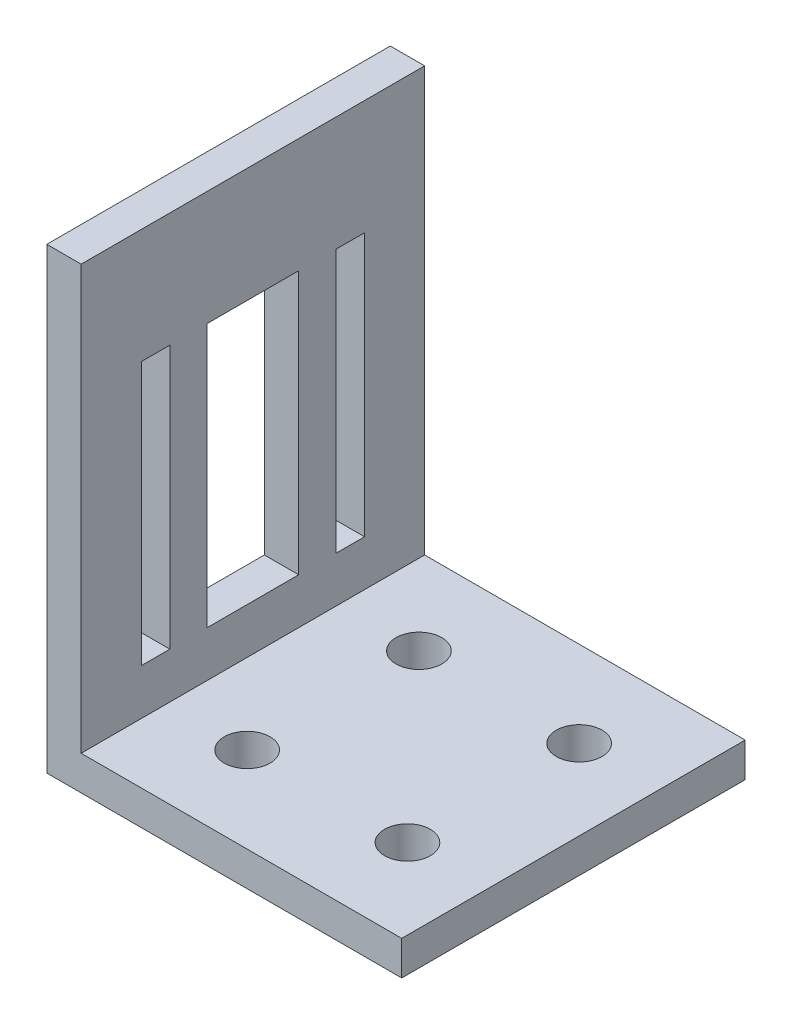
ISO-10303-21;
HEADER;
FILE_DESCRIPTION(('STEP AP214'),'2;1');
FILE_NAME('part.step','',(''),(''),'','','');
FILE_SCHEMA(('AUTOMOTIVE_DESIGN { 1 0 10303 214 1 1 1 1 }'));
ENDSEC;
DATA;
#1=APPLICATION_CONTEXT('core data for automotive mechanical design processes');
#2=APPLICATION_PROTOCOL_DEFINITION('international standard','automotive_design',2000,#1);
#3=PRODUCT_CONTEXT('',#1,'mechanical');
#4=PRODUCT('Part','Part','',(#3));
#5=PRODUCT_RELATED_PRODUCT_CATEGORY('part','',(#4));
#6=PRODUCT_DEFINITION_FORMATION('','',#4);
#7=PRODUCT_DEFINITION_CONTEXT('part definition',#1,'design');
#8=PRODUCT_DEFINITION('design','',#6,#7);
#9=PRODUCT_DEFINITION_SHAPE('','',#8);
#10=(LENGTH_UNIT() NAMED_UNIT(*) SI_UNIT(.MILLI.,.METRE.));
#11=(NAMED_UNIT(*) PLANE_ANGLE_UNIT() SI_UNIT($,.RADIAN.));
#12=(NAMED_UNIT(*) SI_UNIT($,.STERADIAN.) SOLID_ANGLE_UNIT());
#13=UNCERTAINTY_MEASURE_WITH_UNIT(LENGTH_MEASURE(1.E-05),#10,'distance_accuracy_value','');
#14=(GEOMETRIC_REPRESENTATION_CONTEXT(3) GLOBAL_UNCERTAINTY_ASSIGNED_CONTEXT((#13)) GLOBAL_UNIT_ASSIGNED_CONTEXT((#10,
#11,#12)) REPRESENTATION_CONTEXT('',''));
#15=CARTESIAN_POINT('',(0.,0.,0.));
#16=DIRECTION('',(0.,0.,1.));
#17=DIRECTION('',(1.,0.,0.));
#18=AXIS2_PLACEMENT_3D('',#15,#16,#17);
#19=CARTESIAN_POINT('',(0.,0.,30.));
#20=DIRECTION('',(-1.,0.,0.));
#21=DIRECTION('',(0.,-1.,0.));
#22=AXIS2_PLACEMENT_3D('',#19,#20,#21);
#23=PLANE('',#22);
#24=DIRECTION('',(0.,1.,0.));
#25=VECTOR('',#24,1.);
#26=CARTESIAN_POINT('',(0.,0.,0.));
#27=LINE('',#26,#25);
#28=CARTESIAN_POINT('',(0.,0.,0.));
#29=VERTEX_POINT('',#28);
#30=CARTESIAN_POINT('',(0.,3.,0.));
#31=VERTEX_POINT('',#30);
#32=EDGE_CURVE('E283',#29,#31,#27,.T.);
#33=ORIENTED_EDGE('',*,*,#32,.T.);
#34=DIRECTION('',(0.,0.,-1.));
#35=VECTOR('',#34,1.);
#36=CARTESIAN_POINT('',(0.,3.,30.));
#37=LINE('',#36,#35);
#38=CARTESIAN_POINT('',(0.,3.,30.));
#39=VERTEX_POINT('',#38);
#40=EDGE_CURVE('E11',#39,#31,#37,.T.);
#41=ORIENTED_EDGE('',*,*,#40,.F.);
#42=DIRECTION('',(0.,1.,0.));
#43=VECTOR('',#42,1.);
#44=CARTESIAN_POINT('',(0.,0.,30.));
#45=LINE('',#44,#43);
#46=CARTESIAN_POINT('',(0.,0.,30.));
#47=VERTEX_POINT('',#46);
#48=EDGE_CURVE('E286',#47,#39,#45,.T.);
#49=ORIENTED_EDGE('',*,*,#48,.F.);
#50=DIRECTION('',(0.,0.,-1.));
#51=VECTOR('',#50,1.);
#52=CARTESIAN_POINT('',(0.,0.,30.));
#53=LINE('',#52,#51);
#54=EDGE_CURVE('E300',#47,#29,#53,.T.);
#55=ORIENTED_EDGE('',*,*,#54,.T.);
#56=EDGE_LOOP('',(#33,#41,#49,#55));
#57=FACE_BOUND('',#56,.T.);
#58=ADVANCED_FACE('F35',(#57),#23,.F.);
#59=CARTESIAN_POINT('',(0.,3.,30.));
#60=DIRECTION('',(0.,-1.,0.));
#61=DIRECTION('',(1.,0.,0.));
#62=AXIS2_PLACEMENT_3D('',#59,#60,#61);
#63=PLANE('',#62);
#64=CARTESIAN_POINT('',(-21.,3.,22.5));
#65=DIRECTION('',(0.,1.,0.));
#66=DIRECTION('',(0.,0.,-1.));
#67=AXIS2_PLACEMENT_3D('',#64,#65,#66);
#68=CIRCLE('',#67,2.);
#69=CARTESIAN_POINT('',(-21.,3.,20.5));
#70=VERTEX_POINT('',#69);
#71=EDGE_CURVE('E272',#70,#70,#68,.T.);
#72=ORIENTED_EDGE('',*,*,#71,.F.);
#73=EDGE_LOOP('',(#72));
#74=FACE_BOUND('',#73,.T.);
#75=CARTESIAN_POINT('',(-7.,3.,7.5));
#76=DIRECTION('',(0.,1.,0.));
#77=DIRECTION('',(0.,0.,-1.));
#78=AXIS2_PLACEMENT_3D('',#75,#76,#77);
#79=CIRCLE('',#78,2.);
#80=CARTESIAN_POINT('',(-7.,3.,5.5));
#81=VERTEX_POINT('',#80);
#82=EDGE_CURVE('E265',#81,#81,#79,.T.);
#83=ORIENTED_EDGE('',*,*,#82,.F.);
#84=EDGE_LOOP('',(#83));
#85=FACE_BOUND('',#84,.T.);
#86=CARTESIAN_POINT('',(-21.,3.,7.5));
#87=DIRECTION('',(0.,1.,0.));
#88=DIRECTION('',(0.,0.,1.));
#89=AXIS2_PLACEMENT_3D('',#86,#87,#88);
#90=CIRCLE('',#89,2.);
#91=CARTESIAN_POINT('',(-21.,3.,9.5));
#92=VERTEX_POINT('',#91);
#93=EDGE_CURVE('E261',#92,#92,#90,.T.);
#94=ORIENTED_EDGE('',*,*,#93,.F.);
#95=EDGE_LOOP('',(#94));
#96=FACE_BOUND('',#95,.T.);
#97=CARTESIAN_POINT('',(-7.,3.,22.5));
#98=DIRECTION('',(0.,1.,0.));
#99=DIRECTION('',(0.,0.,1.));
#100=AXIS2_PLACEMENT_3D('',#97,#98,#99);
#101=CIRCLE('',#100,2.);
#102=CARTESIAN_POINT('',(-7.,3.,24.5));
#103=VERTEX_POINT('',#102);
#104=EDGE_CURVE('E271',#103,#103,#101,.T.);
#105=ORIENTED_EDGE('',*,*,#104,.F.);
#106=EDGE_LOOP('',(#105));
#107=FACE_BOUND('',#106,.T.);
#108=DIRECTION('',(-1.,0.,0.));
#109=VECTOR('',#108,1.);
#110=CARTESIAN_POINT('',(0.,3.,0.));
#111=LINE('',#110,#109);
#112=CARTESIAN_POINT('',(-28.,3.,0.));
#113=VERTEX_POINT('',#112);
#114=EDGE_CURVE('E303',#31,#113,#111,.T.);
#115=ORIENTED_EDGE('',*,*,#114,.T.);
#116=DIRECTION('',(0.,0.,-1.));
#117=VECTOR('',#116,1.);
#118=CARTESIAN_POINT('',(-28.,3.,30.));
#119=LINE('',#118,#117);
#120=CARTESIAN_POINT('',(-28.,3.,30.));
#121=VERTEX_POINT('',#120);
#122=EDGE_CURVE('E42',#121,#113,#119,.T.);
#123=ORIENTED_EDGE('',*,*,#122,.F.);
#124=DIRECTION('',(-1.,0.,0.));
#125=VECTOR('',#124,1.);
#126=CARTESIAN_POINT('',(0.,3.,30.));
#127=LINE('',#126,#125);
#128=EDGE_CURVE('E289',#39,#121,#127,.T.);
#129=ORIENTED_EDGE('',*,*,#128,.F.);
#130=ORIENTED_EDGE('',*,*,#40,.T.);
#131=EDGE_LOOP('',(#115,#123,#129,#130));
#132=FACE_BOUND('',#131,.T.);
#133=ADVANCED_FACE('F349',(#74,#85,#96,#107,#132),#63,.F.);
#134=CARTESIAN_POINT('',(-28.,3.,30.));
#135=DIRECTION('',(-1.,0.,0.));
#136=DIRECTION('',(0.,0.,1.));
#137=AXIS2_PLACEMENT_3D('',#134,#135,#136);
#138=PLANE('',#137);
#139=DIRECTION('',(0.,1.,0.));
#140=VECTOR('',#139,1.);
#141=CARTESIAN_POINT('',(-28.,3.,24.75));
#142=LINE('',#141,#140);
#143=CARTESIAN_POINT('',(-28.,7.,24.75));
#144=VERTEX_POINT('',#143);
#145=CARTESIAN_POINT('',(-28.,30.,24.75));
#146=VERTEX_POINT('',#145);
#147=EDGE_CURVE('E255',#144,#146,#142,.T.);
#148=ORIENTED_EDGE('',*,*,#147,.T.);
#149=DIRECTION('',(0.,0.,-1.));
#150=VECTOR('',#149,1.);
#151=CARTESIAN_POINT('',(-28.,30.,30.));
#152=LINE('',#151,#150);
#153=CARTESIAN_POINT('',(-28.,30.,22.25));
#154=VERTEX_POINT('',#153);
#155=EDGE_CURVE('E258',#146,#154,#152,.T.);
#156=ORIENTED_EDGE('',*,*,#155,.T.);
#157=DIRECTION('',(0.,-1.,0.));
#158=VECTOR('',#157,1.);
#159=CARTESIAN_POINT('',(-28.,3.,22.25));
#160=LINE('',#159,#158);
#161=CARTESIAN_POINT('',(-28.,7.,22.25));
#162=VERTEX_POINT('',#161);
#163=EDGE_CURVE('E252',#154,#162,#160,.T.);
#164=ORIENTED_EDGE('',*,*,#163,.T.);
#165=DIRECTION('',(0.,0.,1.));
#166=VECTOR('',#165,1.);
#167=CARTESIAN_POINT('',(-28.,7.,30.));
#168=LINE('',#167,#166);
#169=EDGE_CURVE('E164',#162,#144,#168,.T.);
#170=ORIENTED_EDGE('',*,*,#169,.T.);
#171=EDGE_LOOP('',(#148,#156,#164,#170));
#172=FACE_BOUND('',#171,.T.);
#173=DIRECTION('',(0.,1.,0.));
#174=VECTOR('',#173,1.);
#175=CARTESIAN_POINT('',(-28.,2.99999999999999,19.));
#176=LINE('',#175,#174);
#177=CARTESIAN_POINT('',(-28.,7.,19.));
#178=VERTEX_POINT('',#177);
#179=CARTESIAN_POINT('',(-28.,30.,19.));
#180=VERTEX_POINT('',#179);
#181=EDGE_CURVE('E246',#178,#180,#176,.T.);
#182=ORIENTED_EDGE('',*,*,#181,.T.);
#183=DIRECTION('',(0.,0.,-1.));
#184=VECTOR('',#183,1.);
#185=CARTESIAN_POINT('',(-28.,30.,30.));
#186=LINE('',#185,#184);
#187=CARTESIAN_POINT('',(-28.,30.,11.));
#188=VERTEX_POINT('',#187);
#189=EDGE_CURVE('E249',#180,#188,#186,.T.);
#190=ORIENTED_EDGE('',*,*,#189,.T.);
#191=DIRECTION('',(0.,-1.,0.));
#192=VECTOR('',#191,1.);
#193=CARTESIAN_POINT('',(-28.,3.,11.));
#194=LINE('',#193,#192);
#195=CARTESIAN_POINT('',(-28.,7.,11.));
#196=VERTEX_POINT('',#195);
#197=EDGE_CURVE('E240',#188,#196,#194,.T.);
#198=ORIENTED_EDGE('',*,*,#197,.T.);
#199=DIRECTION('',(0.,0.,1.));
#200=VECTOR('',#199,1.);
#201=CARTESIAN_POINT('',(-28.,7.,30.));
#202=LINE('',#201,#200);
#203=EDGE_CURVE('E243',#196,#178,#202,.T.);
#204=ORIENTED_EDGE('',*,*,#203,.T.);
#205=EDGE_LOOP('',(#182,#190,#198,#204));
#206=FACE_BOUND('',#205,.T.);
#207=DIRECTION('',(0.,0.,1.));
#208=VECTOR('',#207,1.);
#209=CARTESIAN_POINT('',(-28.,7.00000000000001,30.));
#210=LINE('',#209,#208);
#211=CARTESIAN_POINT('',(-28.,7.,5.25));
#212=VERTEX_POINT('',#211);
#213=CARTESIAN_POINT('',(-28.,7.,7.75000000000001));
#214=VERTEX_POINT('',#213);
#215=EDGE_CURVE('E234',#212,#214,#210,.T.);
#216=ORIENTED_EDGE('',*,*,#215,.T.);
#217=DIRECTION('',(0.,1.,0.));
#218=VECTOR('',#217,1.);
#219=CARTESIAN_POINT('',(-28.,2.99999999999999,7.75));
#220=LINE('',#219,#218);
#221=CARTESIAN_POINT('',(-28.,30.,7.75));
#222=VERTEX_POINT('',#221);
#223=EDGE_CURVE('E237',#214,#222,#220,.T.);
#224=ORIENTED_EDGE('',*,*,#223,.T.);
#225=DIRECTION('',(0.,0.,-1.));
#226=VECTOR('',#225,1.);
#227=CARTESIAN_POINT('',(-28.,30.,30.));
#228=LINE('',#227,#226);
#229=CARTESIAN_POINT('',(-28.,30.,5.25));
#230=VERTEX_POINT('',#229);
#231=EDGE_CURVE('E188',#222,#230,#228,.T.);
#232=ORIENTED_EDGE('',*,*,#231,.T.);
#233=DIRECTION('',(0.,-1.,0.));
#234=VECTOR('',#233,1.);
#235=CARTESIAN_POINT('',(-28.,3.,5.25));
#236=LINE('',#235,#234);
#237=EDGE_CURVE('E231',#230,#212,#236,.T.);
#238=ORIENTED_EDGE('',*,*,#237,.T.);
#239=EDGE_LOOP('',(#216,#224,#232,#238));
#240=FACE_BOUND('',#239,.T.);
#241=DIRECTION('',(0.,1.,0.));
#242=VECTOR('',#241,1.);
#243=CARTESIAN_POINT('',(-28.,3.,0.));
#244=LINE('',#243,#242);
#245=CARTESIAN_POINT('',(-28.,40.,0.));
#246=VERTEX_POINT('',#245);
#247=EDGE_CURVE('E305',#113,#246,#244,.T.);
#248=ORIENTED_EDGE('',*,*,#247,.T.);
#249=DIRECTION('',(0.,0.,-1.));
#250=VECTOR('',#249,1.);
#251=CARTESIAN_POINT('',(-28.,40.,30.));
#252=LINE('',#251,#250);
#253=CARTESIAN_POINT('',(-28.,40.,30.));
#254=VERTEX_POINT('',#253);
#255=EDGE_CURVE('E320',#254,#246,#252,.T.);
#256=ORIENTED_EDGE('',*,*,#255,.F.);
#257=DIRECTION('',(0.,1.,0.));
#258=VECTOR('',#257,1.);
#259=CARTESIAN_POINT('',(-28.,3.,30.));
#260=LINE('',#259,#258);
#261=EDGE_CURVE('E292',#121,#254,#260,.T.);
#262=ORIENTED_EDGE('',*,*,#261,.F.);
#263=ORIENTED_EDGE('',*,*,#122,.T.);
#264=EDGE_LOOP('',(#248,#256,#262,#263));
#265=FACE_BOUND('',#264,.T.);
#266=ADVANCED_FACE('F327',(#172,#206,#240,#265),#138,.F.);
#267=CARTESIAN_POINT('',(-28.,40.,30.));
#268=DIRECTION('',(0.,-1.,0.));
#269=DIRECTION('',(0.,0.,-1.));
#270=AXIS2_PLACEMENT_3D('',#267,#268,#269);
#271=PLANE('',#270);
#272=DIRECTION('',(-1.,0.,0.));
#273=VECTOR('',#272,1.);
#274=CARTESIAN_POINT('',(-28.,40.,0.));
#275=LINE('',#274,#273);
#276=CARTESIAN_POINT('',(-31.,40.,0.));
#277=VERTEX_POINT('',#276);
#278=EDGE_CURVE('E307',#246,#277,#275,.T.);
#279=ORIENTED_EDGE('',*,*,#278,.T.);
#280=DIRECTION('',(0.,0.,-1.));
#281=VECTOR('',#280,1.);
#282=CARTESIAN_POINT('',(-31.,40.,30.));
#283=LINE('',#282,#281);
#284=CARTESIAN_POINT('',(-31.,40.,30.));
#285=VERTEX_POINT('',#284);
#286=EDGE_CURVE('E317',#285,#277,#283,.T.);
#287=ORIENTED_EDGE('',*,*,#286,.F.);
#288=DIRECTION('',(-1.,0.,0.));
#289=VECTOR('',#288,1.);
#290=CARTESIAN_POINT('',(-28.,40.,30.));
#291=LINE('',#290,#289);
#292=EDGE_CURVE('E294',#254,#285,#291,.T.);
#293=ORIENTED_EDGE('',*,*,#292,.F.);
#294=ORIENTED_EDGE('',*,*,#255,.T.);
#295=EDGE_LOOP('',(#279,#287,#293,#294));
#296=FACE_BOUND('',#295,.T.);
#297=ADVANCED_FACE('F338',(#296),#271,.F.);
#298=CARTESIAN_POINT('',(-31.,0.,30.));
#299=DIRECTION('',(1.,0.,0.));
#300=DIRECTION('',(0.,0.,-1.));
#301=AXIS2_PLACEMENT_3D('',#298,#299,#300);
#302=PLANE('',#301);
#303=DIRECTION('',(0.,-1.,0.));
#304=VECTOR('',#303,1.);
#305=CARTESIAN_POINT('',(-31.,30.,22.25));
#306=LINE('',#305,#304);
#307=CARTESIAN_POINT('',(-31.,30.,22.25));
#308=VERTEX_POINT('',#307);
#309=CARTESIAN_POINT('',(-31.,7.,22.25));
#310=VERTEX_POINT('',#309);
#311=EDGE_CURVE('E171',#308,#310,#306,.T.);
#312=ORIENTED_EDGE('',*,*,#311,.F.);
#313=DIRECTION('',(0.,0.,-1.));
#314=VECTOR('',#313,1.);
#315=CARTESIAN_POINT('',(-31.,30.,22.25));
#316=LINE('',#315,#314);
#317=CARTESIAN_POINT('',(-31.,30.,24.75));
#318=VERTEX_POINT('',#317);
#319=EDGE_CURVE('E176',#318,#308,#316,.T.);
#320=ORIENTED_EDGE('',*,*,#319,.F.);
#321=DIRECTION('',(0.,1.,0.));
#322=VECTOR('',#321,1.);
#323=CARTESIAN_POINT('',(-31.,30.,24.75));
#324=LINE('',#323,#322);
#325=CARTESIAN_POINT('',(-31.,7.,24.75));
#326=VERTEX_POINT('',#325);
#327=EDGE_CURVE('E181',#326,#318,#324,.T.);
#328=ORIENTED_EDGE('',*,*,#327,.F.);
#329=DIRECTION('',(0.,0.,1.));
#330=VECTOR('',#329,1.);
#331=CARTESIAN_POINT('',(-31.,7.,24.75));
#332=LINE('',#331,#330);
#333=EDGE_CURVE('E161',#310,#326,#332,.T.);
#334=ORIENTED_EDGE('',*,*,#333,.F.);
#335=EDGE_LOOP('',(#312,#320,#328,#334));
#336=FACE_BOUND('',#335,.T.);
#337=DIRECTION('',(0.,-1.,0.));
#338=VECTOR('',#337,1.);
#339=CARTESIAN_POINT('',(-31.,30.,11.));
#340=LINE('',#339,#338);
#341=CARTESIAN_POINT('',(-31.,30.,11.));
#342=VERTEX_POINT('',#341);
#343=CARTESIAN_POINT('',(-31.,7.,11.));
#344=VERTEX_POINT('',#343);
#345=EDGE_CURVE('E193',#342,#344,#340,.T.);
#346=ORIENTED_EDGE('',*,*,#345,.F.);
#347=DIRECTION('',(0.,0.,-1.));
#348=VECTOR('',#347,1.);
#349=CARTESIAN_POINT('',(-31.,30.,19.));
#350=LINE('',#349,#348);
#351=CARTESIAN_POINT('',(-31.,30.,19.));
#352=VERTEX_POINT('',#351);
#353=EDGE_CURVE('E191',#352,#342,#350,.T.);
#354=ORIENTED_EDGE('',*,*,#353,.F.);
#355=DIRECTION('',(0.,1.,0.));
#356=VECTOR('',#355,1.);
#357=CARTESIAN_POINT('',(-31.,30.,19.));
#358=LINE('',#357,#356);
#359=CARTESIAN_POINT('',(-31.,7.,19.));
#360=VERTEX_POINT('',#359);
#361=EDGE_CURVE('E199',#360,#352,#358,.T.);
#362=ORIENTED_EDGE('',*,*,#361,.F.);
#363=DIRECTION('',(0.,0.,1.));
#364=VECTOR('',#363,1.);
#365=CARTESIAN_POINT('',(-31.,7.,19.));
#366=LINE('',#365,#364);
#367=EDGE_CURVE('E196',#344,#360,#366,.T.);
#368=ORIENTED_EDGE('',*,*,#367,.F.);
#369=EDGE_LOOP('',(#346,#354,#362,#368));
#370=FACE_BOUND('',#369,.T.);
#371=DIRECTION('',(0.,0.,-1.));
#372=VECTOR('',#371,1.);
#373=CARTESIAN_POINT('',(-31.,30.,7.75));
#374=LINE('',#373,#372);
#375=CARTESIAN_POINT('',(-31.,30.,7.75));
#376=VERTEX_POINT('',#375);
#377=CARTESIAN_POINT('',(-31.,30.,5.25));
#378=VERTEX_POINT('',#377);
#379=EDGE_CURVE('E212',#376,#378,#374,.T.);
#380=ORIENTED_EDGE('',*,*,#379,.F.);
#381=DIRECTION('',(0.,1.,0.));
#382=VECTOR('',#381,1.);
#383=CARTESIAN_POINT('',(-31.,30.,7.75));
#384=LINE('',#383,#382);
#385=CARTESIAN_POINT('',(-31.,7.,7.75000000000001));
#386=VERTEX_POINT('',#385);
#387=EDGE_CURVE('E210',#386,#376,#384,.T.);
#388=ORIENTED_EDGE('',*,*,#387,.F.);
#389=DIRECTION('',(0.,0.,1.));
#390=VECTOR('',#389,1.);
#391=CARTESIAN_POINT('',(-31.,7.,5.25));
#392=LINE('',#391,#390);
#393=CARTESIAN_POINT('',(-31.,7.,5.25));
#394=VERTEX_POINT('',#393);
#395=EDGE_CURVE('E218',#394,#386,#392,.T.);
#396=ORIENTED_EDGE('',*,*,#395,.F.);
#397=DIRECTION('',(0.,-1.,0.));
#398=VECTOR('',#397,1.);
#399=CARTESIAN_POINT('',(-31.,30.,5.25));
#400=LINE('',#399,#398);
#401=EDGE_CURVE('E215',#378,#394,#400,.T.);
#402=ORIENTED_EDGE('',*,*,#401,.F.);
#403=EDGE_LOOP('',(#380,#388,#396,#402));
#404=FACE_BOUND('',#403,.T.);
#405=DIRECTION('',(0.,-1.,0.));
#406=VECTOR('',#405,1.);
#407=CARTESIAN_POINT('',(-31.,0.,0.));
#408=LINE('',#407,#406);
#409=CARTESIAN_POINT('',(-31.,0.,0.));
#410=VERTEX_POINT('',#409);
#411=EDGE_CURVE('E309',#277,#410,#408,.T.);
#412=ORIENTED_EDGE('',*,*,#411,.T.);
#413=DIRECTION('',(0.,0.,-1.));
#414=VECTOR('',#413,1.);
#415=CARTESIAN_POINT('',(-31.,0.,30.));
#416=LINE('',#415,#414);
#417=CARTESIAN_POINT('',(-31.,0.,30.));
#418=VERTEX_POINT('',#417);
#419=EDGE_CURVE('E314',#418,#410,#416,.T.);
#420=ORIENTED_EDGE('',*,*,#419,.F.);
#421=DIRECTION('',(0.,-1.,0.));
#422=VECTOR('',#421,1.);
#423=CARTESIAN_POINT('',(-31.,0.,30.));
#424=LINE('',#423,#422);
#425=EDGE_CURVE('E296',#285,#418,#424,.T.);
#426=ORIENTED_EDGE('',*,*,#425,.F.);
#427=ORIENTED_EDGE('',*,*,#286,.T.);
#428=EDGE_LOOP('',(#412,#420,#426,#427));
#429=FACE_BOUND('',#428,.T.);
#430=ADVANCED_FACE('F178',(#336,#370,#404,#429),#302,.F.);
#431=CARTESIAN_POINT('',(0.,0.,30.));
#432=DIRECTION('',(0.,1.,0.));
#433=DIRECTION('',(0.,0.,1.));
#434=AXIS2_PLACEMENT_3D('',#431,#432,#433);
#435=PLANE('',#434);
#436=CARTESIAN_POINT('',(-21.,0.,22.5));
#437=DIRECTION('',(0.,1.,0.));
#438=DIRECTION('',(0.,0.,-1.));
#439=AXIS2_PLACEMENT_3D('',#436,#437,#438);
#440=CIRCLE('',#439,2.);
#441=CARTESIAN_POINT('',(-21.,0.,20.5));
#442=VERTEX_POINT('',#441);
#443=EDGE_CURVE('E268',#442,#442,#440,.T.);
#444=ORIENTED_EDGE('',*,*,#443,.T.);
#445=EDGE_LOOP('',(#444));
#446=FACE_BOUND('',#445,.T.);
#447=CARTESIAN_POINT('',(-7.,0.,7.5));
#448=DIRECTION('',(0.,1.,0.));
#449=DIRECTION('',(0.,0.,-1.));
#450=AXIS2_PLACEMENT_3D('',#447,#448,#449);
#451=CIRCLE('',#450,2.);
#452=CARTESIAN_POINT('',(-7.,0.,5.5));
#453=VERTEX_POINT('',#452);
#454=EDGE_CURVE('E275',#453,#453,#451,.T.);
#455=ORIENTED_EDGE('',*,*,#454,.T.);
#456=EDGE_LOOP('',(#455));
#457=FACE_BOUND('',#456,.T.);
#458=CARTESIAN_POINT('',(-21.,0.,7.5));
#459=DIRECTION('',(0.,1.,0.));
#460=DIRECTION('',(0.,0.,1.));
#461=AXIS2_PLACEMENT_3D('',#458,#459,#460);
#462=CIRCLE('',#461,2.);
#463=CARTESIAN_POINT('',(-21.,0.,9.5));
#464=VERTEX_POINT('',#463);
#465=EDGE_CURVE('E262',#464,#464,#462,.T.);
#466=ORIENTED_EDGE('',*,*,#465,.T.);
#467=EDGE_LOOP('',(#466));
#468=FACE_BOUND('',#467,.T.);
#469=CARTESIAN_POINT('',(-7.,0.,22.5));
#470=DIRECTION('',(0.,1.,0.));
#471=DIRECTION('',(0.,0.,1.));
#472=AXIS2_PLACEMENT_3D('',#469,#470,#471);
#473=CIRCLE('',#472,2.);
#474=CARTESIAN_POINT('',(-7.,0.,24.5));
#475=VERTEX_POINT('',#474);
#476=EDGE_CURVE('E280',#475,#475,#473,.T.);
#477=ORIENTED_EDGE('',*,*,#476,.T.);
#478=EDGE_LOOP('',(#477));
#479=FACE_BOUND('',#478,.T.);
#480=DIRECTION('',(1.,0.,0.));
#481=VECTOR('',#480,1.);
#482=CARTESIAN_POINT('',(0.,0.,0.));
#483=LINE('',#482,#481);
#484=EDGE_CURVE('E290',#410,#29,#483,.T.);
#485=ORIENTED_EDGE('',*,*,#484,.T.);
#486=ORIENTED_EDGE('',*,*,#54,.F.);
#487=DIRECTION('',(1.,0.,0.));
#488=VECTOR('',#487,1.);
#489=CARTESIAN_POINT('',(0.,0.,30.));
#490=LINE('',#489,#488);
#491=EDGE_CURVE('E298',#418,#47,#490,.T.);
#492=ORIENTED_EDGE('',*,*,#491,.F.);
#493=ORIENTED_EDGE('',*,*,#419,.T.);
#494=EDGE_LOOP('',(#485,#486,#492,#493));
#495=FACE_BOUND('',#494,.T.);
#496=ADVANCED_FACE('F352',(#446,#457,#468,#479,#495),#435,.F.);
#497=CARTESIAN_POINT('',(0.,0.,30.));
#498=DIRECTION('',(0.,0.,1.));
#499=DIRECTION('',(1.,0.,0.));
#500=AXIS2_PLACEMENT_3D('',#497,#498,#499);
#501=PLANE('',#500);
#502=ORIENTED_EDGE('',*,*,#48,.T.);
#503=ORIENTED_EDGE('',*,*,#128,.T.);
#504=ORIENTED_EDGE('',*,*,#261,.T.);
#505=ORIENTED_EDGE('',*,*,#292,.T.);
#506=ORIENTED_EDGE('',*,*,#425,.T.);
#507=ORIENTED_EDGE('',*,*,#491,.T.);
#508=EDGE_LOOP('',(#502,#503,#504,#505,#506,#507));
#509=FACE_BOUND('',#508,.T.);
#510=ADVANCED_FACE('F345',(#509),#501,.T.);
#511=CARTESIAN_POINT('',(0.,0.,0.));
#512=DIRECTION('',(0.,0.,1.));
#513=DIRECTION('',(1.,0.,0.));
#514=AXIS2_PLACEMENT_3D('',#511,#512,#513);
#515=PLANE('',#514);
#516=ORIENTED_EDGE('',*,*,#32,.F.);
#517=ORIENTED_EDGE('',*,*,#484,.F.);
#518=ORIENTED_EDGE('',*,*,#411,.F.);
#519=ORIENTED_EDGE('',*,*,#278,.F.);
#520=ORIENTED_EDGE('',*,*,#247,.F.);
#521=ORIENTED_EDGE('',*,*,#114,.F.);
#522=EDGE_LOOP('',(#516,#517,#518,#519,#520,#521));
#523=FACE_BOUND('',#522,.T.);
#524=ADVANCED_FACE('F333',(#523),#515,.F.);
#525=CARTESIAN_POINT('',(-7.,0.,22.5));
#526=DIRECTION('',(0.,1.,0.));
#527=DIRECTION('',(0.,0.,1.));
#528=AXIS2_PLACEMENT_3D('',#525,#526,#527);
#529=CYLINDRICAL_SURFACE('',#528,2.);
#530=ORIENTED_EDGE('',*,*,#476,.F.);
#531=EDGE_LOOP('',(#530));
#532=FACE_BOUND('',#531,.T.);
#533=ORIENTED_EDGE('',*,*,#104,.T.);
#534=EDGE_LOOP('',(#533));
#535=FACE_BOUND('',#534,.T.);
#536=ADVANCED_FACE('F518',(#532,#535),#529,.F.);
#537=CARTESIAN_POINT('',(-21.,0.,7.5));
#538=DIRECTION('',(0.,1.,0.));
#539=DIRECTION('',(0.,0.,1.));
#540=AXIS2_PLACEMENT_3D('',#537,#538,#539);
#541=CYLINDRICAL_SURFACE('',#540,2.);
#542=ORIENTED_EDGE('',*,*,#465,.F.);
#543=EDGE_LOOP('',(#542));
#544=FACE_BOUND('',#543,.T.);
#545=ORIENTED_EDGE('',*,*,#93,.T.);
#546=EDGE_LOOP('',(#545));
#547=FACE_BOUND('',#546,.T.);
#548=ADVANCED_FACE('F514',(#544,#547),#541,.F.);
#549=CARTESIAN_POINT('',(-7.,0.,7.5));
#550=DIRECTION('',(0.,1.,0.));
#551=DIRECTION('',(0.,0.,1.));
#552=AXIS2_PLACEMENT_3D('',#549,#550,#551);
#553=CYLINDRICAL_SURFACE('',#552,2.);
#554=ORIENTED_EDGE('',*,*,#454,.F.);
#555=EDGE_LOOP('',(#554));
#556=FACE_BOUND('',#555,.T.);
#557=ORIENTED_EDGE('',*,*,#82,.T.);
#558=EDGE_LOOP('',(#557));
#559=FACE_BOUND('',#558,.T.);
#560=ADVANCED_FACE('F517',(#556,#559),#553,.F.);
#561=CARTESIAN_POINT('',(-21.,0.,22.5));
#562=DIRECTION('',(0.,1.,0.));
#563=DIRECTION('',(0.,0.,1.));
#564=AXIS2_PLACEMENT_3D('',#561,#562,#563);
#565=CYLINDRICAL_SURFACE('',#564,2.);
#566=ORIENTED_EDGE('',*,*,#443,.F.);
#567=EDGE_LOOP('',(#566));
#568=FACE_BOUND('',#567,.T.);
#569=ORIENTED_EDGE('',*,*,#71,.T.);
#570=EDGE_LOOP('',(#569));
#571=FACE_BOUND('',#570,.T.);
#572=ADVANCED_FACE('F402',(#568,#571),#565,.F.);
#573=CARTESIAN_POINT('',(0.,30.,7.75));
#574=DIRECTION('',(0.,0.,1.));
#575=DIRECTION('',(0.,-1.,0.));
#576=AXIS2_PLACEMENT_3D('',#573,#574,#575);
#577=PLANE('',#576);
#578=DIRECTION('',(-1.,0.,0.));
#579=VECTOR('',#578,1.);
#580=CARTESIAN_POINT('',(0.,7.,7.75000000000001));
#581=LINE('',#580,#579);
#582=EDGE_CURVE('E194',#214,#386,#581,.T.);
#583=ORIENTED_EDGE('',*,*,#582,.T.);
#584=ORIENTED_EDGE('',*,*,#387,.T.);
#585=DIRECTION('',(-1.,0.,0.));
#586=VECTOR('',#585,1.);
#587=CARTESIAN_POINT('',(0.,30.,7.75));
#588=LINE('',#587,#586);
#589=EDGE_CURVE('E221',#222,#376,#588,.T.);
#590=ORIENTED_EDGE('',*,*,#589,.F.);
#591=ORIENTED_EDGE('',*,*,#223,.F.);
#592=EDGE_LOOP('',(#583,#584,#590,#591));
#593=FACE_BOUND('',#592,.T.);
#594=ADVANCED_FACE('F396',(#593),#577,.F.);
#595=CARTESIAN_POINT('',(0.,7.,5.25));
#596=DIRECTION('',(0.,-1.,0.));
#597=DIRECTION('',(0.,0.,-1.));
#598=AXIS2_PLACEMENT_3D('',#595,#596,#597);
#599=PLANE('',#598);
#600=DIRECTION('',(-1.,0.,0.));
#601=VECTOR('',#600,1.);
#602=CARTESIAN_POINT('',(0.,7.,5.25));
#603=LINE('',#602,#601);
#604=EDGE_CURVE('E223',#212,#394,#603,.T.);
#605=ORIENTED_EDGE('',*,*,#604,.T.);
#606=ORIENTED_EDGE('',*,*,#395,.T.);
#607=ORIENTED_EDGE('',*,*,#582,.F.);
#608=ORIENTED_EDGE('',*,*,#215,.F.);
#609=EDGE_LOOP('',(#605,#606,#607,#608));
#610=FACE_BOUND('',#609,.T.);
#611=ADVANCED_FACE('F401',(#610),#599,.F.);
#612=CARTESIAN_POINT('',(0.,30.,5.25));
#613=DIRECTION('',(0.,0.,-1.));
#614=DIRECTION('',(-1.,0.,0.));
#615=AXIS2_PLACEMENT_3D('',#612,#613,#614);
#616=PLANE('',#615);
#617=DIRECTION('',(-1.,0.,0.));
#618=VECTOR('',#617,1.);
#619=CARTESIAN_POINT('',(0.,30.,5.25));
#620=LINE('',#619,#618);
#621=EDGE_CURVE('E225',#230,#378,#620,.T.);
#622=ORIENTED_EDGE('',*,*,#621,.T.);
#623=ORIENTED_EDGE('',*,*,#401,.T.);
#624=ORIENTED_EDGE('',*,*,#604,.F.);
#625=ORIENTED_EDGE('',*,*,#237,.F.);
#626=EDGE_LOOP('',(#622,#623,#624,#625));
#627=FACE_BOUND('',#626,.T.);
#628=ADVANCED_FACE('F414',(#627),#616,.F.);
#629=CARTESIAN_POINT('',(0.,30.,7.75));
#630=DIRECTION('',(0.,1.,0.));
#631=DIRECTION('',(0.,0.,1.));
#632=AXIS2_PLACEMENT_3D('',#629,#630,#631);
#633=PLANE('',#632);
#634=ORIENTED_EDGE('',*,*,#589,.T.);
#635=ORIENTED_EDGE('',*,*,#379,.T.);
#636=ORIENTED_EDGE('',*,*,#621,.F.);
#637=ORIENTED_EDGE('',*,*,#231,.F.);
#638=EDGE_LOOP('',(#634,#635,#636,#637));
#639=FACE_BOUND('',#638,.T.);
#640=ADVANCED_FACE('F424',(#639),#633,.F.);
#641=CARTESIAN_POINT('',(0.,30.,19.));
#642=DIRECTION('',(0.,1.,0.));
#643=DIRECTION('',(0.,0.,1.));
#644=AXIS2_PLACEMENT_3D('',#641,#642,#643);
#645=PLANE('',#644);
#646=DIRECTION('',(-1.,0.,0.));
#647=VECTOR('',#646,1.);
#648=CARTESIAN_POINT('',(0.,30.,19.));
#649=LINE('',#648,#647);
#650=EDGE_CURVE('E203',#180,#352,#649,.T.);
#651=ORIENTED_EDGE('',*,*,#650,.T.);
#652=ORIENTED_EDGE('',*,*,#353,.T.);
#653=DIRECTION('',(-1.,0.,0.));
#654=VECTOR('',#653,1.);
#655=CARTESIAN_POINT('',(0.,30.,11.));
#656=LINE('',#655,#654);
#657=EDGE_CURVE('E202',#188,#342,#656,.T.);
#658=ORIENTED_EDGE('',*,*,#657,.F.);
#659=ORIENTED_EDGE('',*,*,#189,.F.);
#660=EDGE_LOOP('',(#651,#652,#658,#659));
#661=FACE_BOUND('',#660,.T.);
#662=ADVANCED_FACE('F434',(#661),#645,.F.);
#663=CARTESIAN_POINT('',(0.,30.,19.));
#664=DIRECTION('',(0.,0.,1.));
#665=DIRECTION('',(0.,-1.,0.));
#666=AXIS2_PLACEMENT_3D('',#663,#664,#665);
#667=PLANE('',#666);
#668=DIRECTION('',(-1.,0.,0.));
#669=VECTOR('',#668,1.);
#670=CARTESIAN_POINT('',(0.,7.,19.));
#671=LINE('',#670,#669);
#672=EDGE_CURVE('E205',#178,#360,#671,.T.);
#673=ORIENTED_EDGE('',*,*,#672,.T.);
#674=ORIENTED_EDGE('',*,*,#361,.T.);
#675=ORIENTED_EDGE('',*,*,#650,.F.);
#676=ORIENTED_EDGE('',*,*,#181,.F.);
#677=EDGE_LOOP('',(#673,#674,#675,#676));
#678=FACE_BOUND('',#677,.T.);
#679=ADVANCED_FACE('F444',(#678),#667,.F.);
#680=CARTESIAN_POINT('',(0.,7.,19.));
#681=DIRECTION('',(0.,-1.,0.));
#682=DIRECTION('',(0.,0.,-1.));
#683=AXIS2_PLACEMENT_3D('',#680,#681,#682);
#684=PLANE('',#683);
#685=DIRECTION('',(-1.,0.,0.));
#686=VECTOR('',#685,1.);
#687=CARTESIAN_POINT('',(0.,7.,11.));
#688=LINE('',#687,#686);
#689=EDGE_CURVE('E57',#196,#344,#688,.T.);
#690=ORIENTED_EDGE('',*,*,#689,.T.);
#691=ORIENTED_EDGE('',*,*,#367,.T.);
#692=ORIENTED_EDGE('',*,*,#672,.F.);
#693=ORIENTED_EDGE('',*,*,#203,.F.);
#694=EDGE_LOOP('',(#690,#691,#692,#693));
#695=FACE_BOUND('',#694,.T.);
#696=ADVANCED_FACE('F454',(#695),#684,.F.);
#697=CARTESIAN_POINT('',(0.,30.,11.));
#698=DIRECTION('',(0.,0.,-1.));
#699=DIRECTION('',(0.,1.,0.));
#700=AXIS2_PLACEMENT_3D('',#697,#698,#699);
#701=PLANE('',#700);
#702=ORIENTED_EDGE('',*,*,#657,.T.);
#703=ORIENTED_EDGE('',*,*,#345,.T.);
#704=ORIENTED_EDGE('',*,*,#689,.F.);
#705=ORIENTED_EDGE('',*,*,#197,.F.);
#706=EDGE_LOOP('',(#702,#703,#704,#705));
#707=FACE_BOUND('',#706,.T.);
#708=ADVANCED_FACE('F464',(#707),#701,.F.);
#709=CARTESIAN_POINT('',(0.,30.,22.25));
#710=DIRECTION('',(0.,1.,0.));
#711=DIRECTION('',(0.,0.,1.));
#712=AXIS2_PLACEMENT_3D('',#709,#710,#711);
#713=PLANE('',#712);
#714=DIRECTION('',(-1.,0.,0.));
#715=VECTOR('',#714,1.);
#716=CARTESIAN_POINT('',(0.,30.,24.75));
#717=LINE('',#716,#715);
#718=EDGE_CURVE('E186',#146,#318,#717,.T.);
#719=ORIENTED_EDGE('',*,*,#718,.T.);
#720=ORIENTED_EDGE('',*,*,#319,.T.);
#721=DIRECTION('',(-1.,0.,0.));
#722=VECTOR('',#721,1.);
#723=CARTESIAN_POINT('',(0.,30.,22.25));
#724=LINE('',#723,#722);
#725=EDGE_CURVE('E167',#154,#308,#724,.T.);
#726=ORIENTED_EDGE('',*,*,#725,.F.);
#727=ORIENTED_EDGE('',*,*,#155,.F.);
#728=EDGE_LOOP('',(#719,#720,#726,#727));
#729=FACE_BOUND('',#728,.T.);
#730=ADVANCED_FACE('F474',(#729),#713,.F.);
#731=CARTESIAN_POINT('',(0.,30.,24.75));
#732=DIRECTION('',(0.,0.,1.));
#733=DIRECTION('',(0.,-1.,0.));
#734=AXIS2_PLACEMENT_3D('',#731,#732,#733);
#735=PLANE('',#734);
#736=DIRECTION('',(-1.,0.,0.));
#737=VECTOR('',#736,1.);
#738=CARTESIAN_POINT('',(0.,7.,24.75));
#739=LINE('',#738,#737);
#740=EDGE_CURVE('E166',#144,#326,#739,.T.);
#741=ORIENTED_EDGE('',*,*,#740,.T.);
#742=ORIENTED_EDGE('',*,*,#327,.T.);
#743=ORIENTED_EDGE('',*,*,#718,.F.);
#744=ORIENTED_EDGE('',*,*,#147,.F.);
#745=EDGE_LOOP('',(#741,#742,#743,#744));
#746=FACE_BOUND('',#745,.T.);
#747=ADVANCED_FACE('F483',(#746),#735,.F.);
#748=CARTESIAN_POINT('',(0.,7.,24.75));
#749=DIRECTION('',(0.,-1.,0.));
#750=DIRECTION('',(0.,0.,-1.));
#751=AXIS2_PLACEMENT_3D('',#748,#749,#750);
#752=PLANE('',#751);
#753=DIRECTION('',(-1.,0.,0.));
#754=VECTOR('',#753,1.);
#755=CARTESIAN_POINT('',(0.,7.,22.25));
#756=LINE('',#755,#754);
#757=EDGE_CURVE('E49',#162,#310,#756,.T.);
#758=ORIENTED_EDGE('',*,*,#757,.T.);
#759=ORIENTED_EDGE('',*,*,#333,.T.);
#760=ORIENTED_EDGE('',*,*,#740,.F.);
#761=ORIENTED_EDGE('',*,*,#169,.F.);
#762=EDGE_LOOP('',(#758,#759,#760,#761));
#763=FACE_BOUND('',#762,.T.);
#764=ADVANCED_FACE('F158',(#763),#752,.F.);
#765=CARTESIAN_POINT('',(0.,30.,22.25));
#766=DIRECTION('',(0.,0.,-1.));
#767=DIRECTION('',(0.,1.,0.));
#768=AXIS2_PLACEMENT_3D('',#765,#766,#767);
#769=PLANE('',#768);
#770=ORIENTED_EDGE('',*,*,#725,.T.);
#771=ORIENTED_EDGE('',*,*,#311,.T.);
#772=ORIENTED_EDGE('',*,*,#757,.F.);
#773=ORIENTED_EDGE('',*,*,#163,.F.);
#774=EDGE_LOOP('',(#770,#771,#772,#773));
#775=FACE_BOUND('',#774,.T.);
#776=ADVANCED_FACE('F172',(#775),#769,.F.);
#777=CLOSED_SHELL('',(#58,#133,#266,#297,#430,#496,#510,#524,#536,#548,#560,#572,#594,#611,#628,
#640,#662,#679,#696,#708,#730,#747,#764,#776));
#778=MANIFOLD_SOLID_BREP('B2',#777);
#779=ADVANCED_BREP_SHAPE_REPRESENTATION('',(#18,#778),#14);
#780=SHAPE_DEFINITION_REPRESENTATION(#9,#779);
ENDSEC;
END-ISO-10303-21;
